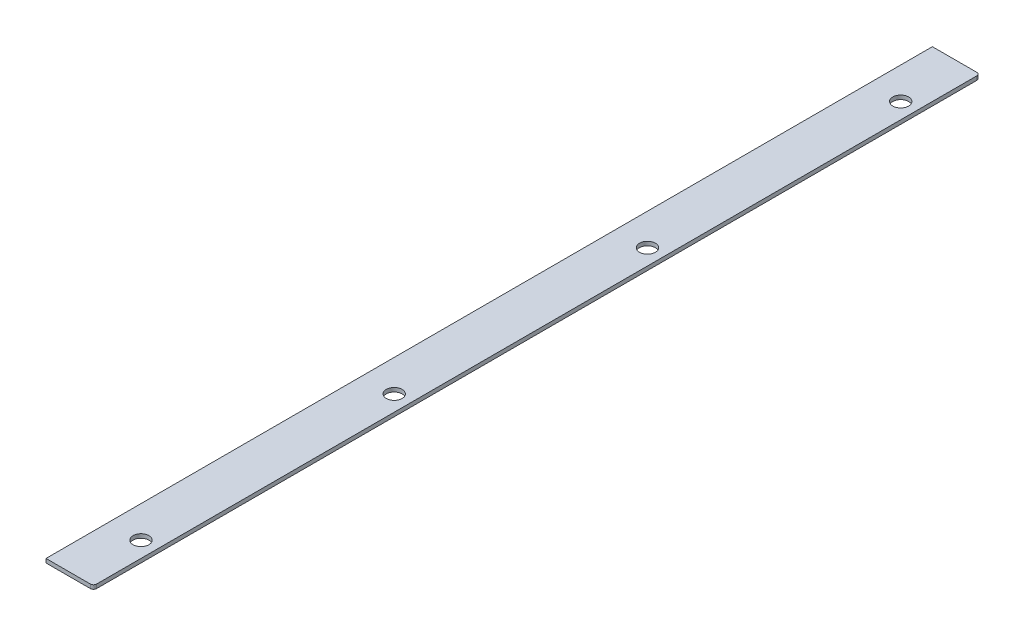
ISO-10303-21;
HEADER;
FILE_DESCRIPTION(('STEP AP214'),'2;1');
FILE_NAME('part.step','',(''),(''),'','','');
FILE_SCHEMA(('AUTOMOTIVE_DESIGN { 1 0 10303 214 1 1 1 1 }'));
ENDSEC;
DATA;
#1=APPLICATION_CONTEXT('core data for automotive mechanical design processes');
#2=APPLICATION_PROTOCOL_DEFINITION('international standard','automotive_design',2000,#1);
#3=PRODUCT_CONTEXT('',#1,'mechanical');
#4=PRODUCT('Part','Part','',(#3));
#5=PRODUCT_RELATED_PRODUCT_CATEGORY('part','',(#4));
#6=PRODUCT_DEFINITION_FORMATION('','',#4);
#7=PRODUCT_DEFINITION_CONTEXT('part definition',#1,'design');
#8=PRODUCT_DEFINITION('design','',#6,#7);
#9=PRODUCT_DEFINITION_SHAPE('','',#8);
#10=(LENGTH_UNIT() NAMED_UNIT(*) SI_UNIT(.MILLI.,.METRE.));
#11=(NAMED_UNIT(*) PLANE_ANGLE_UNIT() SI_UNIT($,.RADIAN.));
#12=(NAMED_UNIT(*) SI_UNIT($,.STERADIAN.) SOLID_ANGLE_UNIT());
#13=UNCERTAINTY_MEASURE_WITH_UNIT(LENGTH_MEASURE(1.E-05),#10,'distance_accuracy_value','');
#14=(GEOMETRIC_REPRESENTATION_CONTEXT(3) GLOBAL_UNCERTAINTY_ASSIGNED_CONTEXT((#13)) GLOBAL_UNIT_ASSIGNED_CONTEXT((#10,
#11,#12)) REPRESENTATION_CONTEXT('',''));
#15=CARTESIAN_POINT('',(0.,0.,0.));
#16=DIRECTION('',(0.,0.,1.));
#17=DIRECTION('',(1.,0.,0.));
#18=AXIS2_PLACEMENT_3D('',#15,#16,#17);
#19=CARTESIAN_POINT('',(0.,3.175,0.));
#20=DIRECTION('',(1.,0.,0.));
#21=DIRECTION('',(0.,0.,-1.));
#22=AXIS2_PLACEMENT_3D('',#19,#20,#21);
#23=PLANE('',#22);
#24=DIRECTION('',(0.,0.,1.));
#25=VECTOR('',#24,1.);
#26=CARTESIAN_POINT('',(0.,0.,0.));
#27=LINE('',#26,#25);
#28=CARTESIAN_POINT('',(-1.31838984174237E-13,0.,-711.2));
#29=VERTEX_POINT('',#28);
#30=CARTESIAN_POINT('',(0.,0.,0.));
#31=VERTEX_POINT('',#30);
#32=EDGE_CURVE('E107',#29,#31,#27,.T.);
#33=ORIENTED_EDGE('',*,*,#32,.T.);
#34=DIRECTION('',(0.,-1.,0.));
#35=VECTOR('',#34,1.);
#36=CARTESIAN_POINT('',(0.,3.175,0.));
#37=LINE('',#36,#35);
#38=CARTESIAN_POINT('',(0.,3.175,0.));
#39=VERTEX_POINT('',#38);
#40=EDGE_CURVE('E92',#39,#31,#37,.T.);
#41=ORIENTED_EDGE('',*,*,#40,.F.);
#42=DIRECTION('',(0.,0.,1.));
#43=VECTOR('',#42,1.);
#44=CARTESIAN_POINT('',(0.,3.175,0.));
#45=LINE('',#44,#43);
#46=CARTESIAN_POINT('',(-1.31838984174237E-13,3.175,-711.2));
#47=VERTEX_POINT('',#46);
#48=EDGE_CURVE('E96',#47,#39,#45,.T.);
#49=ORIENTED_EDGE('',*,*,#48,.F.);
#50=DIRECTION('',(0.,-1.,0.));
#51=VECTOR('',#50,1.);
#52=CARTESIAN_POINT('',(-1.31838984174237E-13,3.175,-711.2));
#53=LINE('',#52,#51);
#54=EDGE_CURVE('E109',#47,#29,#53,.T.);
#55=ORIENTED_EDGE('',*,*,#54,.T.);
#56=EDGE_LOOP('',(#33,#41,#49,#55));
#57=FACE_BOUND('',#56,.T.);
#58=ADVANCED_FACE('F35',(#57),#23,.F.);
#59=CARTESIAN_POINT('',(0.,3.175,0.));
#60=DIRECTION('',(0.,0.,-1.));
#61=DIRECTION('',(-1.,0.,0.));
#62=AXIS2_PLACEMENT_3D('',#59,#60,#61);
#63=PLANE('',#62);
#64=DIRECTION('',(1.,0.,0.));
#65=VECTOR('',#64,1.);
#66=CARTESIAN_POINT('',(0.,0.,0.));
#67=LINE('',#66,#65);
#68=CARTESIAN_POINT('',(35.56,0.,0.));
#69=VERTEX_POINT('',#68);
#70=EDGE_CURVE('E135',#31,#69,#67,.T.);
#71=ORIENTED_EDGE('',*,*,#70,.T.);
#72=DIRECTION('',(0.,-1.,0.));
#73=VECTOR('',#72,1.);
#74=CARTESIAN_POINT('',(35.56,3.175,0.));
#75=LINE('',#74,#73);
#76=CARTESIAN_POINT('',(35.56,3.175,0.));
#77=VERTEX_POINT('',#76);
#78=EDGE_CURVE('E58',#69,#77,#75,.F.);
#79=ORIENTED_EDGE('',*,*,#78,.T.);
#80=DIRECTION('',(1.,0.,0.));
#81=VECTOR('',#80,1.);
#82=CARTESIAN_POINT('',(0.,3.175,0.));
#83=LINE('',#82,#81);
#84=EDGE_CURVE('E88',#39,#77,#83,.T.);
#85=ORIENTED_EDGE('',*,*,#84,.F.);
#86=ORIENTED_EDGE('',*,*,#40,.T.);
#87=EDGE_LOOP('',(#71,#79,#85,#86));
#88=FACE_BOUND('',#87,.T.);
#89=ADVANCED_FACE('F90',(#88),#63,.F.);
#90=CARTESIAN_POINT('',(38.1,3.175,0.));
#91=DIRECTION('',(-1.,0.,0.));
#92=DIRECTION('',(0.,0.,1.));
#93=AXIS2_PLACEMENT_3D('',#90,#91,#92);
#94=PLANE('',#93);
#95=DIRECTION('',(0.,0.,-1.));
#96=VECTOR('',#95,1.);
#97=CARTESIAN_POINT('',(38.1,3.175,0.));
#98=LINE('',#97,#96);
#99=CARTESIAN_POINT('',(38.1,3.175,-2.54));
#100=VERTEX_POINT('',#99);
#101=CARTESIAN_POINT('',(38.0999999999999,3.175,-708.66));
#102=VERTEX_POINT('',#101);
#103=EDGE_CURVE('E95',#100,#102,#98,.T.);
#104=ORIENTED_EDGE('',*,*,#103,.F.);
#105=DIRECTION('',(0.,-1.,0.));
#106=VECTOR('',#105,1.);
#107=CARTESIAN_POINT('',(38.1,3.175,-2.54));
#108=LINE('',#107,#106);
#109=CARTESIAN_POINT('',(38.1,0.,-2.54));
#110=VERTEX_POINT('',#109);
#111=EDGE_CURVE('E111',#100,#110,#108,.T.);
#112=ORIENTED_EDGE('',*,*,#111,.T.);
#113=DIRECTION('',(0.,0.,-1.));
#114=VECTOR('',#113,1.);
#115=CARTESIAN_POINT('',(38.1,0.,0.));
#116=LINE('',#115,#114);
#117=CARTESIAN_POINT('',(38.0999999999999,0.,-708.66));
#118=VERTEX_POINT('',#117);
#119=EDGE_CURVE('E136',#110,#118,#116,.T.);
#120=ORIENTED_EDGE('',*,*,#119,.T.);
#121=DIRECTION('',(0.,-1.,0.));
#122=VECTOR('',#121,1.);
#123=CARTESIAN_POINT('',(38.0999999999999,3.175,-708.66));
#124=LINE('',#123,#122);
#125=EDGE_CURVE('E108',#118,#102,#124,.F.);
#126=ORIENTED_EDGE('',*,*,#125,.T.);
#127=EDGE_LOOP('',(#104,#112,#120,#126));
#128=FACE_BOUND('',#127,.T.);
#129=ADVANCED_FACE('F127',(#128),#94,.F.);
#130=CARTESIAN_POINT('',(-1.31838984174237E-13,3.175,-711.2));
#131=DIRECTION('',(0.,0.,1.));
#132=DIRECTION('',(1.,0.,0.));
#133=AXIS2_PLACEMENT_3D('',#130,#131,#132);
#134=PLANE('',#133);
#135=DIRECTION('',(-1.,0.,0.));
#136=VECTOR('',#135,1.);
#137=CARTESIAN_POINT('',(-1.31838984174237E-13,3.175,-711.2));
#138=LINE('',#137,#136);
#139=CARTESIAN_POINT('',(35.5599999999999,3.175,-711.2));
#140=VERTEX_POINT('',#139);
#141=EDGE_CURVE('E100',#140,#47,#138,.T.);
#142=ORIENTED_EDGE('',*,*,#141,.F.);
#143=DIRECTION('',(0.,-1.,0.));
#144=VECTOR('',#143,1.);
#145=CARTESIAN_POINT('',(35.5599999999999,3.175,-711.2));
#146=LINE('',#145,#144);
#147=CARTESIAN_POINT('',(35.5599999999999,0.,-711.2));
#148=VERTEX_POINT('',#147);
#149=EDGE_CURVE('E11',#140,#148,#146,.T.);
#150=ORIENTED_EDGE('',*,*,#149,.T.);
#151=DIRECTION('',(-1.,0.,0.));
#152=VECTOR('',#151,1.);
#153=CARTESIAN_POINT('',(-1.31838984174237E-13,0.,-711.2));
#154=LINE('',#153,#152);
#155=EDGE_CURVE('E104',#148,#29,#154,.T.);
#156=ORIENTED_EDGE('',*,*,#155,.T.);
#157=ORIENTED_EDGE('',*,*,#54,.F.);
#158=EDGE_LOOP('',(#142,#150,#156,#157));
#159=FACE_BOUND('',#158,.T.);
#160=ADVANCED_FACE('F144',(#159),#134,.F.);
#161=CARTESIAN_POINT('',(-1.31838984174237E-13,3.175,-711.2));
#162=DIRECTION('',(0.,-1.,0.));
#163=DIRECTION('',(0.,0.,-1.));
#164=AXIS2_PLACEMENT_3D('',#161,#162,#163);
#165=PLANE('',#164);
#166=CARTESIAN_POINT('',(25.3999999999999,3.175,-50.8));
#167=DIRECTION('',(0.,1.,0.));
#168=DIRECTION('',(0.,0.,1.));
#169=AXIS2_PLACEMENT_3D('',#166,#167,#168);
#170=CIRCLE('',#169,6.35);
#171=CARTESIAN_POINT('',(25.3999999999999,3.175,-44.45));
#172=VERTEX_POINT('',#171);
#173=EDGE_CURVE('E191',#172,#172,#170,.T.);
#174=ORIENTED_EDGE('',*,*,#173,.F.);
#175=EDGE_LOOP('',(#174));
#176=FACE_BOUND('',#175,.T.);
#177=CARTESIAN_POINT('',(25.3999999999999,3.175,-254.));
#178=DIRECTION('',(0.,1.,0.));
#179=DIRECTION('',(0.,0.,1.));
#180=AXIS2_PLACEMENT_3D('',#177,#178,#179);
#181=CIRCLE('',#180,6.35);
#182=CARTESIAN_POINT('',(25.3999999999999,3.175,-247.65));
#183=VERTEX_POINT('',#182);
#184=EDGE_CURVE('E193',#183,#183,#181,.T.);
#185=ORIENTED_EDGE('',*,*,#184,.F.);
#186=EDGE_LOOP('',(#185));
#187=FACE_BOUND('',#186,.T.);
#188=CARTESIAN_POINT('',(25.3999999999999,3.175,-457.2));
#189=DIRECTION('',(0.,1.,0.));
#190=DIRECTION('',(0.,0.,1.));
#191=AXIS2_PLACEMENT_3D('',#188,#189,#190);
#192=CIRCLE('',#191,6.35);
#193=CARTESIAN_POINT('',(25.3999999999999,3.175,-450.85));
#194=VERTEX_POINT('',#193);
#195=EDGE_CURVE('E199',#194,#194,#192,.T.);
#196=ORIENTED_EDGE('',*,*,#195,.F.);
#197=EDGE_LOOP('',(#196));
#198=FACE_BOUND('',#197,.T.);
#199=CARTESIAN_POINT('',(25.3999999999999,3.175,-660.4));
#200=DIRECTION('',(0.,1.,0.));
#201=DIRECTION('',(0.,0.,1.));
#202=AXIS2_PLACEMENT_3D('',#199,#200,#201);
#203=CIRCLE('',#202,6.35);
#204=CARTESIAN_POINT('',(25.3999999999999,3.175,-654.05));
#205=VERTEX_POINT('',#204);
#206=EDGE_CURVE('E205',#205,#205,#203,.T.);
#207=ORIENTED_EDGE('',*,*,#206,.F.);
#208=EDGE_LOOP('',(#207));
#209=FACE_BOUND('',#208,.T.);
#210=ORIENTED_EDGE('',*,*,#84,.T.);
#211=CARTESIAN_POINT('',(35.56,3.175,-2.54));
#212=DIRECTION('',(0.,-1.,0.));
#213=DIRECTION('',(0.,0.,-1.));
#214=AXIS2_PLACEMENT_3D('',#211,#212,#213);
#215=CIRCLE('',#214,2.54);
#216=EDGE_CURVE('E43',#77,#100,#215,.F.);
#217=ORIENTED_EDGE('',*,*,#216,.T.);
#218=ORIENTED_EDGE('',*,*,#103,.T.);
#219=CARTESIAN_POINT('',(35.5599999999999,3.175,-708.66));
#220=DIRECTION('',(0.,-1.,0.));
#221=DIRECTION('',(0.,0.,-1.));
#222=AXIS2_PLACEMENT_3D('',#219,#220,#221);
#223=CIRCLE('',#222,2.54);
#224=EDGE_CURVE('E50',#102,#140,#223,.F.);
#225=ORIENTED_EDGE('',*,*,#224,.T.);
#226=ORIENTED_EDGE('',*,*,#141,.T.);
#227=ORIENTED_EDGE('',*,*,#48,.T.);
#228=EDGE_LOOP('',(#210,#217,#218,#225,#226,#227));
#229=FACE_BOUND('',#228,.T.);
#230=ADVANCED_FACE('F99',(#176,#187,#198,#209,#229),#165,.F.);
#231=CARTESIAN_POINT('',(-1.31838984174237E-13,0.,-711.2));
#232=DIRECTION('',(0.,-1.,0.));
#233=DIRECTION('',(0.,0.,-1.));
#234=AXIS2_PLACEMENT_3D('',#231,#232,#233);
#235=PLANE('',#234);
#236=CARTESIAN_POINT('',(25.3999999999999,0.,-50.8));
#237=DIRECTION('',(0.,1.,0.));
#238=DIRECTION('',(0.,0.,1.));
#239=AXIS2_PLACEMENT_3D('',#236,#237,#238);
#240=CIRCLE('',#239,6.35);
#241=CARTESIAN_POINT('',(25.3999999999999,0.,-44.45));
#242=VERTEX_POINT('',#241);
#243=EDGE_CURVE('E188',#242,#242,#240,.T.);
#244=ORIENTED_EDGE('',*,*,#243,.T.);
#245=EDGE_LOOP('',(#244));
#246=FACE_BOUND('',#245,.T.);
#247=CARTESIAN_POINT('',(25.3999999999999,0.,-254.));
#248=DIRECTION('',(0.,1.,0.));
#249=DIRECTION('',(0.,0.,1.));
#250=AXIS2_PLACEMENT_3D('',#247,#248,#249);
#251=CIRCLE('',#250,6.35);
#252=CARTESIAN_POINT('',(25.3999999999999,0.,-247.65));
#253=VERTEX_POINT('',#252);
#254=EDGE_CURVE('E196',#253,#253,#251,.T.);
#255=ORIENTED_EDGE('',*,*,#254,.T.);
#256=EDGE_LOOP('',(#255));
#257=FACE_BOUND('',#256,.T.);
#258=CARTESIAN_POINT('',(25.3999999999999,0.,-457.2));
#259=DIRECTION('',(0.,1.,0.));
#260=DIRECTION('',(0.,0.,1.));
#261=AXIS2_PLACEMENT_3D('',#258,#259,#260);
#262=CIRCLE('',#261,6.35);
#263=CARTESIAN_POINT('',(25.3999999999999,0.,-450.85));
#264=VERTEX_POINT('',#263);
#265=EDGE_CURVE('E202',#264,#264,#262,.T.);
#266=ORIENTED_EDGE('',*,*,#265,.T.);
#267=EDGE_LOOP('',(#266));
#268=FACE_BOUND('',#267,.T.);
#269=CARTESIAN_POINT('',(25.3999999999999,0.,-660.4));
#270=DIRECTION('',(0.,1.,0.));
#271=DIRECTION('',(0.,0.,1.));
#272=AXIS2_PLACEMENT_3D('',#269,#270,#271);
#273=CIRCLE('',#272,6.35);
#274=CARTESIAN_POINT('',(25.3999999999999,0.,-654.05));
#275=VERTEX_POINT('',#274);
#276=EDGE_CURVE('E139',#275,#275,#273,.T.);
#277=ORIENTED_EDGE('',*,*,#276,.T.);
#278=EDGE_LOOP('',(#277));
#279=FACE_BOUND('',#278,.T.);
#280=ORIENTED_EDGE('',*,*,#119,.F.);
#281=CARTESIAN_POINT('',(35.56,0.,-2.54));
#282=DIRECTION('',(0.,-1.,0.));
#283=DIRECTION('',(0.,0.,-1.));
#284=AXIS2_PLACEMENT_3D('',#281,#282,#283);
#285=CIRCLE('',#284,2.54);
#286=EDGE_CURVE('E120',#110,#69,#285,.T.);
#287=ORIENTED_EDGE('',*,*,#286,.T.);
#288=ORIENTED_EDGE('',*,*,#70,.F.);
#289=ORIENTED_EDGE('',*,*,#32,.F.);
#290=ORIENTED_EDGE('',*,*,#155,.F.);
#291=CARTESIAN_POINT('',(35.5599999999999,0.,-708.66));
#292=DIRECTION('',(0.,-1.,0.));
#293=DIRECTION('',(0.,0.,-1.));
#294=AXIS2_PLACEMENT_3D('',#291,#292,#293);
#295=CIRCLE('',#294,2.54);
#296=EDGE_CURVE('E118',#148,#118,#295,.T.);
#297=ORIENTED_EDGE('',*,*,#296,.T.);
#298=EDGE_LOOP('',(#280,#287,#288,#289,#290,#297));
#299=FACE_BOUND('',#298,.T.);
#300=ADVANCED_FACE('F134',(#246,#257,#268,#279,#299),#235,.T.);
#301=CARTESIAN_POINT('',(35.56,3.175,-2.54));
#302=DIRECTION('',(0.,-1.,0.));
#303=DIRECTION('',(0.,0.,-1.));
#304=AXIS2_PLACEMENT_3D('',#301,#302,#303);
#305=CYLINDRICAL_SURFACE('',#304,2.54);
#306=ORIENTED_EDGE('',*,*,#216,.F.);
#307=ORIENTED_EDGE('',*,*,#78,.F.);
#308=ORIENTED_EDGE('',*,*,#286,.F.);
#309=ORIENTED_EDGE('',*,*,#111,.F.);
#310=EDGE_LOOP('',(#306,#307,#308,#309));
#311=FACE_BOUND('',#310,.T.);
#312=ADVANCED_FACE('F132',(#311),#305,.T.);
#313=CARTESIAN_POINT('',(35.5599999999999,3.175,-708.66));
#314=DIRECTION('',(0.,-1.,0.));
#315=DIRECTION('',(0.,0.,-1.));
#316=AXIS2_PLACEMENT_3D('',#313,#314,#315);
#317=CYLINDRICAL_SURFACE('',#316,2.54);
#318=ORIENTED_EDGE('',*,*,#224,.F.);
#319=ORIENTED_EDGE('',*,*,#125,.F.);
#320=ORIENTED_EDGE('',*,*,#296,.F.);
#321=ORIENTED_EDGE('',*,*,#149,.F.);
#322=EDGE_LOOP('',(#318,#319,#320,#321));
#323=FACE_BOUND('',#322,.T.);
#324=ADVANCED_FACE('F37',(#323),#317,.T.);
#325=CARTESIAN_POINT('',(25.3999999999999,0.,-660.4));
#326=DIRECTION('',(0.,1.,0.));
#327=DIRECTION('',(0.,0.,1.));
#328=AXIS2_PLACEMENT_3D('',#325,#326,#327);
#329=CYLINDRICAL_SURFACE('',#328,6.35);
#330=ORIENTED_EDGE('',*,*,#276,.F.);
#331=EDGE_LOOP('',(#330));
#332=FACE_BOUND('',#331,.T.);
#333=ORIENTED_EDGE('',*,*,#206,.T.);
#334=EDGE_LOOP('',(#333));
#335=FACE_BOUND('',#334,.T.);
#336=ADVANCED_FACE('F148',(#332,#335),#329,.F.);
#337=CARTESIAN_POINT('',(25.3999999999999,0.,-457.2));
#338=DIRECTION('',(0.,1.,0.));
#339=DIRECTION('',(0.,0.,1.));
#340=AXIS2_PLACEMENT_3D('',#337,#338,#339);
#341=CYLINDRICAL_SURFACE('',#340,6.35);
#342=ORIENTED_EDGE('',*,*,#265,.F.);
#343=EDGE_LOOP('',(#342));
#344=FACE_BOUND('',#343,.T.);
#345=ORIENTED_EDGE('',*,*,#195,.T.);
#346=EDGE_LOOP('',(#345));
#347=FACE_BOUND('',#346,.T.);
#348=ADVANCED_FACE('F153',(#344,#347),#341,.F.);
#349=CARTESIAN_POINT('',(25.3999999999999,0.,-254.));
#350=DIRECTION('',(0.,1.,0.));
#351=DIRECTION('',(0.,0.,1.));
#352=AXIS2_PLACEMENT_3D('',#349,#350,#351);
#353=CYLINDRICAL_SURFACE('',#352,6.35);
#354=ORIENTED_EDGE('',*,*,#254,.F.);
#355=EDGE_LOOP('',(#354));
#356=FACE_BOUND('',#355,.T.);
#357=ORIENTED_EDGE('',*,*,#184,.T.);
#358=EDGE_LOOP('',(#357));
#359=FACE_BOUND('',#358,.T.);
#360=ADVANCED_FACE('F175',(#356,#359),#353,.F.);
#361=CARTESIAN_POINT('',(25.3999999999999,0.,-50.8));
#362=DIRECTION('',(0.,1.,0.));
#363=DIRECTION('',(0.,0.,1.));
#364=AXIS2_PLACEMENT_3D('',#361,#362,#363);
#365=CYLINDRICAL_SURFACE('',#364,6.35);
#366=ORIENTED_EDGE('',*,*,#243,.F.);
#367=EDGE_LOOP('',(#366));
#368=FACE_BOUND('',#367,.T.);
#369=ORIENTED_EDGE('',*,*,#173,.T.);
#370=EDGE_LOOP('',(#369));
#371=FACE_BOUND('',#370,.T.);
#372=ADVANCED_FACE('F179',(#368,#371),#365,.F.);
#373=CLOSED_SHELL('',(#58,#89,#129,#160,#230,#300,#312,#324,#336,#348,#360,#372));
#374=MANIFOLD_SOLID_BREP('B2',#373);
#375=ADVANCED_BREP_SHAPE_REPRESENTATION('',(#18,#374),#14);
#376=SHAPE_DEFINITION_REPRESENTATION(#9,#375);
ENDSEC;
END-ISO-10303-21;
